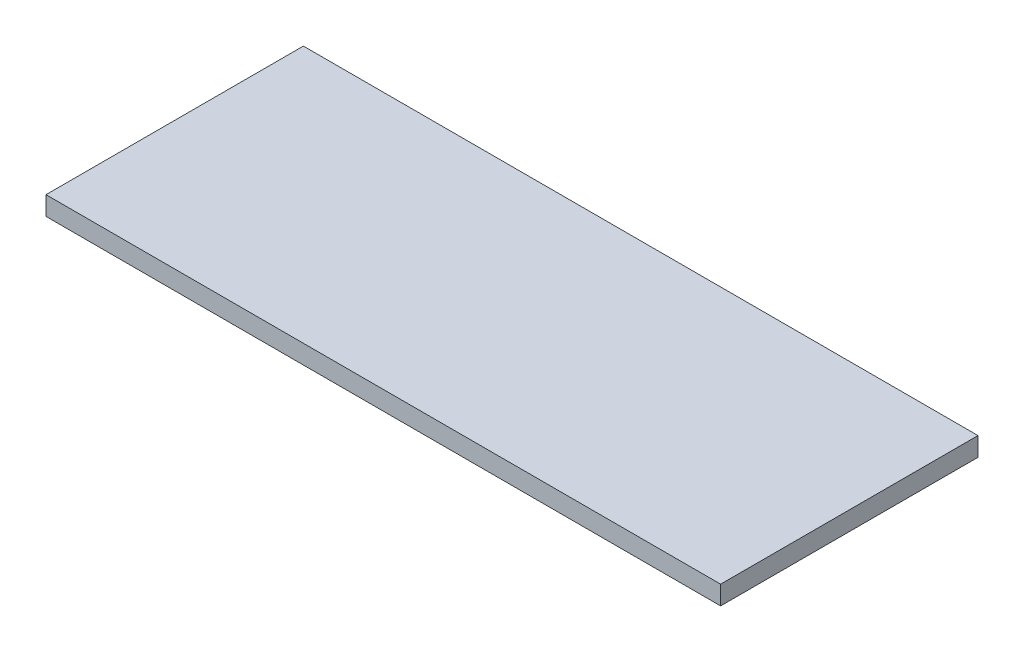
ISO-10303-21;
HEADER;
FILE_DESCRIPTION(('STEP AP214'),'2;1');
FILE_NAME('part.step','',(''),(''),'','','');
FILE_SCHEMA(('AUTOMOTIVE_DESIGN { 1 0 10303 214 1 1 1 1 }'));
ENDSEC;
DATA;
#1=APPLICATION_CONTEXT('core data for automotive mechanical design processes');
#2=APPLICATION_PROTOCOL_DEFINITION('international standard','automotive_design',2000,#1);
#3=PRODUCT_CONTEXT('',#1,'mechanical');
#4=PRODUCT('Part','Part','',(#3));
#5=PRODUCT_RELATED_PRODUCT_CATEGORY('part','',(#4));
#6=PRODUCT_DEFINITION_FORMATION('','',#4);
#7=PRODUCT_DEFINITION_CONTEXT('part definition',#1,'design');
#8=PRODUCT_DEFINITION('design','',#6,#7);
#9=PRODUCT_DEFINITION_SHAPE('','',#8);
#10=(LENGTH_UNIT() NAMED_UNIT(*) SI_UNIT(.MILLI.,.METRE.));
#11=(NAMED_UNIT(*) PLANE_ANGLE_UNIT() SI_UNIT($,.RADIAN.));
#12=(NAMED_UNIT(*) SI_UNIT($,.STERADIAN.) SOLID_ANGLE_UNIT());
#13=UNCERTAINTY_MEASURE_WITH_UNIT(LENGTH_MEASURE(1.E-05),#10,'distance_accuracy_value','');
#14=(GEOMETRIC_REPRESENTATION_CONTEXT(3) GLOBAL_UNCERTAINTY_ASSIGNED_CONTEXT((#13)) GLOBAL_UNIT_ASSIGNED_CONTEXT((#10,
#11,#12)) REPRESENTATION_CONTEXT('',''));
#15=CARTESIAN_POINT('',(0.,0.,0.));
#16=DIRECTION('',(0.,0.,1.));
#17=DIRECTION('',(1.,0.,0.));
#18=AXIS2_PLACEMENT_3D('',#15,#16,#17);
#19=CARTESIAN_POINT('',(0.,3.,0.));
#20=DIRECTION('',(1.,0.,0.));
#21=DIRECTION('',(0.,0.,-1.));
#22=AXIS2_PLACEMENT_3D('',#19,#20,#21);
#23=PLANE('',#22);
#24=DIRECTION('',(0.,0.,1.));
#25=VECTOR('',#24,1.);
#26=CARTESIAN_POINT('',(0.,0.,0.));
#27=LINE('',#26,#25);
#28=CARTESIAN_POINT('',(0.,0.,-40.9381606325427));
#29=VERTEX_POINT('',#28);
#30=CARTESIAN_POINT('',(0.,0.,0.));
#31=VERTEX_POINT('',#30);
#32=EDGE_CURVE('E107',#29,#31,#27,.T.);
#33=ORIENTED_EDGE('',*,*,#32,.T.);
#34=DIRECTION('',(0.,-1.,0.));
#35=VECTOR('',#34,1.);
#36=CARTESIAN_POINT('',(0.,3.,0.));
#37=LINE('',#36,#35);
#38=CARTESIAN_POINT('',(0.,3.,0.));
#39=VERTEX_POINT('',#38);
#40=EDGE_CURVE('E11',#39,#31,#37,.T.);
#41=ORIENTED_EDGE('',*,*,#40,.F.);
#42=DIRECTION('',(0.,0.,1.));
#43=VECTOR('',#42,1.);
#44=CARTESIAN_POINT('',(0.,3.,0.));
#45=LINE('',#44,#43);
#46=CARTESIAN_POINT('',(0.,3.,-40.9381606325427));
#47=VERTEX_POINT('',#46);
#48=EDGE_CURVE('E91',#47,#39,#45,.T.);
#49=ORIENTED_EDGE('',*,*,#48,.F.);
#50=DIRECTION('',(0.,-1.,0.));
#51=VECTOR('',#50,1.);
#52=CARTESIAN_POINT('',(0.,3.,-40.9381606325427));
#53=LINE('',#52,#51);
#54=EDGE_CURVE('E103',#47,#29,#53,.T.);
#55=ORIENTED_EDGE('',*,*,#54,.T.);
#56=EDGE_LOOP('',(#33,#41,#49,#55));
#57=FACE_BOUND('',#56,.T.);
#58=ADVANCED_FACE('F39',(#57),#23,.F.);
#59=CARTESIAN_POINT('',(0.,3.,0.));
#60=DIRECTION('',(0.,0.,-1.));
#61=DIRECTION('',(-1.,0.,0.));
#62=AXIS2_PLACEMENT_3D('',#59,#60,#61);
#63=PLANE('',#62);
#64=DIRECTION('',(1.,0.,0.));
#65=VECTOR('',#64,1.);
#66=CARTESIAN_POINT('',(0.,0.,0.));
#67=LINE('',#66,#65);
#68=CARTESIAN_POINT('',(107.301073657928,0.,0.));
#69=VERTEX_POINT('',#68);
#70=EDGE_CURVE('E96',#31,#69,#67,.T.);
#71=ORIENTED_EDGE('',*,*,#70,.T.);
#72=DIRECTION('',(0.,-1.,0.));
#73=VECTOR('',#72,1.);
#74=CARTESIAN_POINT('',(107.301073657928,3.,0.));
#75=LINE('',#74,#73);
#76=CARTESIAN_POINT('',(107.301073657928,3.,0.));
#77=VERTEX_POINT('',#76);
#78=EDGE_CURVE('E48',#77,#69,#75,.T.);
#79=ORIENTED_EDGE('',*,*,#78,.F.);
#80=DIRECTION('',(1.,0.,0.));
#81=VECTOR('',#80,1.);
#82=CARTESIAN_POINT('',(0.,3.,0.));
#83=LINE('',#82,#81);
#84=EDGE_CURVE('E86',#39,#77,#83,.T.);
#85=ORIENTED_EDGE('',*,*,#84,.F.);
#86=ORIENTED_EDGE('',*,*,#40,.T.);
#87=EDGE_LOOP('',(#71,#79,#85,#86));
#88=FACE_BOUND('',#87,.T.);
#89=ADVANCED_FACE('F95',(#88),#63,.F.);
#90=CARTESIAN_POINT('',(107.301073657928,3.,0.));
#91=DIRECTION('',(-1.,0.,0.));
#92=DIRECTION('',(0.,0.,1.));
#93=AXIS2_PLACEMENT_3D('',#90,#91,#92);
#94=PLANE('',#93);
#95=DIRECTION('',(0.,0.,-1.));
#96=VECTOR('',#95,1.);
#97=CARTESIAN_POINT('',(107.301073657928,0.,0.));
#98=LINE('',#97,#96);
#99=CARTESIAN_POINT('',(107.301073657928,0.,-40.9381606325427));
#100=VERTEX_POINT('',#99);
#101=EDGE_CURVE('E73',#69,#100,#98,.T.);
#102=ORIENTED_EDGE('',*,*,#101,.T.);
#103=DIRECTION('',(0.,-1.,0.));
#104=VECTOR('',#103,1.);
#105=CARTESIAN_POINT('',(107.301073657928,3.,-40.9381606325427));
#106=LINE('',#105,#104);
#107=CARTESIAN_POINT('',(107.301073657928,3.,-40.9381606325427));
#108=VERTEX_POINT('',#107);
#109=EDGE_CURVE('E98',#108,#100,#106,.T.);
#110=ORIENTED_EDGE('',*,*,#109,.F.);
#111=DIRECTION('',(0.,0.,-1.));
#112=VECTOR('',#111,1.);
#113=CARTESIAN_POINT('',(107.301073657928,3.,0.));
#114=LINE('',#113,#112);
#115=EDGE_CURVE('E89',#77,#108,#114,.T.);
#116=ORIENTED_EDGE('',*,*,#115,.F.);
#117=ORIENTED_EDGE('',*,*,#78,.T.);
#118=EDGE_LOOP('',(#102,#110,#116,#117));
#119=FACE_BOUND('',#118,.T.);
#120=ADVANCED_FACE('F99',(#119),#94,.F.);
#121=CARTESIAN_POINT('',(0.,3.,-40.9381606325427));
#122=DIRECTION('',(0.,0.,1.));
#123=DIRECTION('',(1.,0.,0.));
#124=AXIS2_PLACEMENT_3D('',#121,#122,#123);
#125=PLANE('',#124);
#126=DIRECTION('',(-1.,0.,0.));
#127=VECTOR('',#126,1.);
#128=CARTESIAN_POINT('',(0.,0.,-40.9381606325427));
#129=LINE('',#128,#127);
#130=EDGE_CURVE('E79',#100,#29,#129,.T.);
#131=ORIENTED_EDGE('',*,*,#130,.T.);
#132=ORIENTED_EDGE('',*,*,#54,.F.);
#133=DIRECTION('',(-1.,0.,0.));
#134=VECTOR('',#133,1.);
#135=CARTESIAN_POINT('',(0.,3.,-40.9381606325427));
#136=LINE('',#135,#134);
#137=EDGE_CURVE('E56',#108,#47,#136,.T.);
#138=ORIENTED_EDGE('',*,*,#137,.F.);
#139=ORIENTED_EDGE('',*,*,#109,.T.);
#140=EDGE_LOOP('',(#131,#132,#138,#139));
#141=FACE_BOUND('',#140,.T.);
#142=ADVANCED_FACE('F120',(#141),#125,.F.);
#143=CARTESIAN_POINT('',(0.,3.,0.));
#144=DIRECTION('',(0.,-1.,0.));
#145=DIRECTION('',(0.,0.,-1.));
#146=AXIS2_PLACEMENT_3D('',#143,#144,#145);
#147=PLANE('',#146);
#148=ORIENTED_EDGE('',*,*,#48,.T.);
#149=ORIENTED_EDGE('',*,*,#84,.T.);
#150=ORIENTED_EDGE('',*,*,#115,.T.);
#151=ORIENTED_EDGE('',*,*,#137,.T.);
#152=EDGE_LOOP('',(#148,#149,#150,#151));
#153=FACE_BOUND('',#152,.T.);
#154=ADVANCED_FACE('F87',(#153),#147,.F.);
#155=CARTESIAN_POINT('',(0.,0.,0.));
#156=DIRECTION('',(0.,-1.,0.));
#157=DIRECTION('',(0.,0.,-1.));
#158=AXIS2_PLACEMENT_3D('',#155,#156,#157);
#159=PLANE('',#158);
#160=ORIENTED_EDGE('',*,*,#32,.F.);
#161=ORIENTED_EDGE('',*,*,#130,.F.);
#162=ORIENTED_EDGE('',*,*,#101,.F.);
#163=ORIENTED_EDGE('',*,*,#70,.F.);
#164=EDGE_LOOP('',(#160,#161,#162,#163));
#165=FACE_BOUND('',#164,.T.);
#166=ADVANCED_FACE('F123',(#165),#159,.T.);
#167=CLOSED_SHELL('',(#58,#89,#120,#142,#154,#166));
#168=MANIFOLD_SOLID_BREP('B2',#167);
#169=ADVANCED_BREP_SHAPE_REPRESENTATION('',(#18,#168),#14);
#170=SHAPE_DEFINITION_REPRESENTATION(#9,#169);
ENDSEC;
END-ISO-10303-21;
